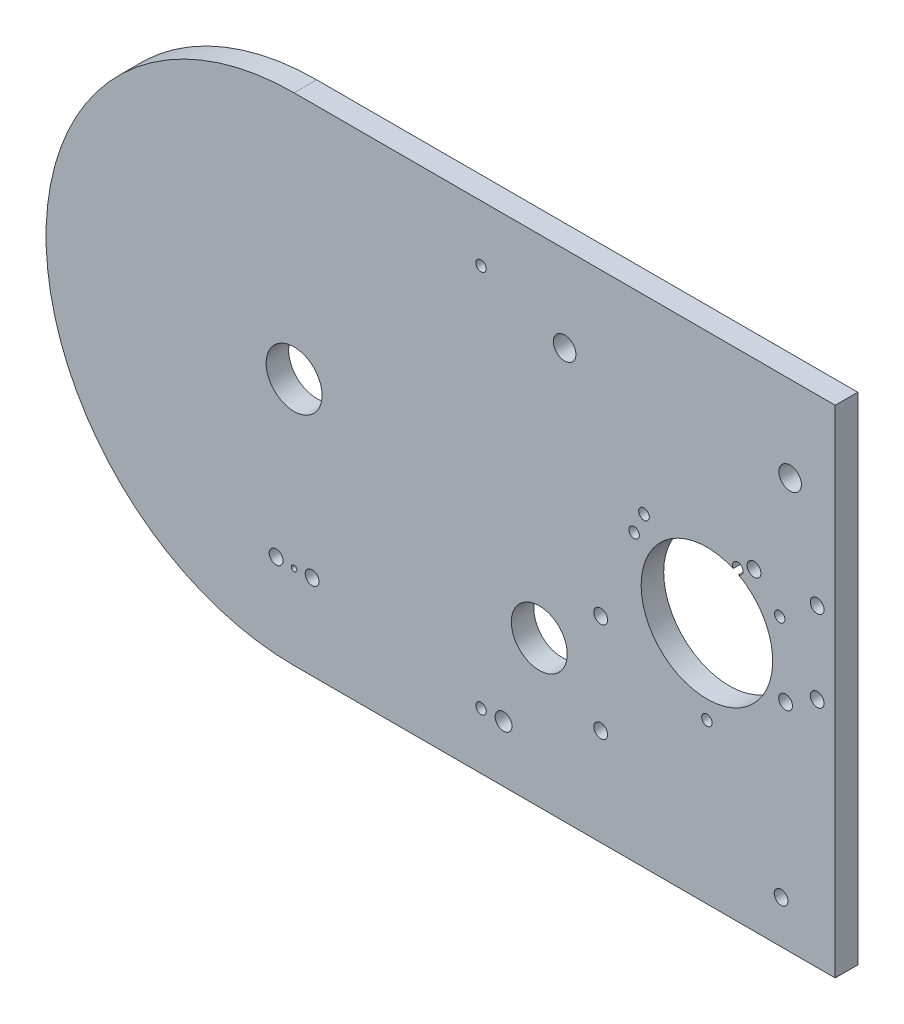
ISO-10303-21;
HEADER;
FILE_DESCRIPTION(('STEP AP214'),'2;1');
FILE_NAME('part.step','',(''),(''),'','','');
FILE_SCHEMA(('AUTOMOTIVE_DESIGN { 1 0 10303 214 1 1 1 1 }'));
ENDSEC;
DATA;
#1=APPLICATION_CONTEXT('core data for automotive mechanical design processes');
#2=APPLICATION_PROTOCOL_DEFINITION('international standard','automotive_design',2000,#1);
#3=PRODUCT_CONTEXT('',#1,'mechanical');
#4=PRODUCT('Part','Part','',(#3));
#5=PRODUCT_RELATED_PRODUCT_CATEGORY('part','',(#4));
#6=PRODUCT_DEFINITION_FORMATION('','',#4);
#7=PRODUCT_DEFINITION_CONTEXT('part definition',#1,'design');
#8=PRODUCT_DEFINITION('design','',#6,#7);
#9=PRODUCT_DEFINITION_SHAPE('','',#8);
#10=(LENGTH_UNIT() NAMED_UNIT(*) SI_UNIT(.MILLI.,.METRE.));
#11=(NAMED_UNIT(*) PLANE_ANGLE_UNIT() SI_UNIT($,.RADIAN.));
#12=(NAMED_UNIT(*) SI_UNIT($,.STERADIAN.) SOLID_ANGLE_UNIT());
#13=UNCERTAINTY_MEASURE_WITH_UNIT(LENGTH_MEASURE(1.E-05),#10,'distance_accuracy_value','');
#14=(GEOMETRIC_REPRESENTATION_CONTEXT(3) GLOBAL_UNCERTAINTY_ASSIGNED_CONTEXT((#13)) GLOBAL_UNIT_ASSIGNED_CONTEXT((#10,
#11,#12)) REPRESENTATION_CONTEXT('',''));
#15=CARTESIAN_POINT('',(0.,0.,0.));
#16=DIRECTION('',(0.,0.,1.));
#17=DIRECTION('',(1.,0.,0.));
#18=AXIS2_PLACEMENT_3D('',#15,#16,#17);
#19=CARTESIAN_POINT('',(0.,0.,6.35));
#20=DIRECTION('',(0.,0.,1.));
#21=DIRECTION('',(1.,0.,0.));
#22=AXIS2_PLACEMENT_3D('',#19,#20,#21);
#23=PLANE('',#22);
#24=CARTESIAN_POINT('',(116.268983634015,-25.0154088515495,6.35));
#25=DIRECTION('',(0.,0.,-1.));
#26=DIRECTION('',(-1.,0.,0.));
#27=AXIS2_PLACEMENT_3D('',#24,#25,#26);
#28=CIRCLE('',#27,1.47319999999998);
#29=CARTESIAN_POINT('',(114.795783634015,-25.0154088515495,6.35));
#30=VERTEX_POINT('',#29);
#31=EDGE_CURVE('E534',#30,#30,#28,.F.);
#32=ORIENTED_EDGE('',*,*,#31,.F.);
#33=EDGE_LOOP('',(#32));
#34=FACE_BOUND('',#33,.T.);
#35=CARTESIAN_POINT('',(136.769352977,10.4922724244268,6.35));
#36=DIRECTION('',(0.,0.,-1.));
#37=DIRECTION('',(-1.,0.,0.));
#38=AXIS2_PLACEMENT_3D('',#35,#36,#37);
#39=CIRCLE('',#38,1.47319999999997);
#40=CARTESIAN_POINT('',(135.296152977,10.4922724244268,6.35));
#41=VERTEX_POINT('',#40);
#42=EDGE_CURVE('E538',#41,#41,#39,.F.);
#43=ORIENTED_EDGE('',*,*,#42,.F.);
#44=EDGE_LOOP('',(#43));
#45=FACE_BOUND('',#44,.T.);
#46=CARTESIAN_POINT('',(95.7686142910309,10.4922724244268,6.35));
#47=DIRECTION('',(0.,0.,-1.));
#48=DIRECTION('',(-1.,0.,0.));
#49=AXIS2_PLACEMENT_3D('',#46,#47,#48);
#50=CIRCLE('',#49,1.4732);
#51=CARTESIAN_POINT('',(94.2954142910309,10.4922724244268,6.35));
#52=VERTEX_POINT('',#51);
#53=EDGE_CURVE('E546',#52,#52,#50,.F.);
#54=ORIENTED_EDGE('',*,*,#53,.F.);
#55=EDGE_LOOP('',(#54));
#56=FACE_BOUND('',#55,.T.);
#57=CARTESIAN_POINT('',(116.268983634015,-1.34362133423192,6.35));
#58=DIRECTION('',(0.,0.,-1.));
#59=DIRECTION('',(-1.,0.,0.));
#60=AXIS2_PLACEMENT_3D('',#57,#58,#59);
#61=CIRCLE('',#60,18.5269999999999);
#62=CARTESIAN_POINT('',(123.664724974641,15.6432188375763,6.35));
#63=VERTEX_POINT('',#62);
#64=CARTESIAN_POINT('',(125.180243201368,14.8995058869427,6.35));
#65=VERTEX_POINT('',#64);
#66=EDGE_CURVE('E101',#63,#65,#61,.F.);
#67=ORIENTED_EDGE('',*,*,#66,.F.);
#68=CARTESIAN_POINT('',(124.968,16.382999999999,6.35));
#69=DIRECTION('',(0.,0.,1.));
#70=DIRECTION('',(1.,0.,0.));
#71=AXIS2_PLACEMENT_3D('',#68,#69,#70);
#72=CIRCLE('',#71,1.49859999999997);
#73=EDGE_CURVE('E92',#65,#63,#72,.T.);
#74=ORIENTED_EDGE('',*,*,#73,.F.);
#75=EDGE_LOOP('',(#67,#74));
#76=FACE_BOUND('',#75,.T.);
#77=CARTESIAN_POINT('',(98.5519999999999,16.382999999999,6.35));
#78=DIRECTION('',(0.,0.,1.));
#79=DIRECTION('',(1.,0.,0.));
#80=AXIS2_PLACEMENT_3D('',#77,#78,#79);
#81=CIRCLE('',#80,1.49859999999999);
#82=CARTESIAN_POINT('',(100.0506,16.382999999999,6.35));
#83=VERTEX_POINT('',#82);
#84=EDGE_CURVE('E107',#83,#83,#81,.T.);
#85=ORIENTED_EDGE('',*,*,#84,.F.);
#86=EDGE_LOOP('',(#85));
#87=FACE_BOUND('',#86,.T.);
#88=CARTESIAN_POINT('',(59.0043258396006,-53.975,6.35));
#89=DIRECTION('',(0.,0.,1.));
#90=DIRECTION('',(1.,0.,0.));
#91=AXIS2_PLACEMENT_3D('',#88,#89,#90);
#92=CIRCLE('',#91,2.38125);
#93=CARTESIAN_POINT('',(61.3855758396006,-53.975,6.35));
#94=VERTEX_POINT('',#93);
#95=EDGE_CURVE('E116',#94,#94,#92,.T.);
#96=ORIENTED_EDGE('',*,*,#95,.F.);
#97=EDGE_LOOP('',(#96));
#98=FACE_BOUND('',#97,.T.);
#99=CARTESIAN_POINT('',(0.00594458088814826,-46.140475683147,6.35));
#100=DIRECTION('',(0.,0.,1.));
#101=DIRECTION('',(1.,0.,0.));
#102=AXIS2_PLACEMENT_3D('',#99,#100,#101);
#103=CIRCLE('',#102,0.793749999999994);
#104=CARTESIAN_POINT('',(0.799694580888142,-46.140475683147,6.35));
#105=VERTEX_POINT('',#104);
#106=EDGE_CURVE('E122',#105,#105,#103,.T.);
#107=ORIENTED_EDGE('',*,*,#106,.F.);
#108=EDGE_LOOP('',(#107));
#109=FACE_BOUND('',#108,.T.);
#110=CARTESIAN_POINT('',(129.54,18.414999999999,6.35));
#111=DIRECTION('',(0.,0.,1.));
#112=DIRECTION('',(1.,0.,0.));
#113=AXIS2_PLACEMENT_3D('',#110,#111,#112);
#114=CIRCLE('',#113,1.94309999999998);
#115=CARTESIAN_POINT('',(131.4831,18.414999999999,6.35));
#116=VERTEX_POINT('',#115);
#117=EDGE_CURVE('E128',#116,#116,#114,.T.);
#118=ORIENTED_EDGE('',*,*,#117,.F.);
#119=EDGE_LOOP('',(#118));
#120=FACE_BOUND('',#119,.T.);
#121=CARTESIAN_POINT('',(147.32,18.414999999999,6.35));
#122=DIRECTION('',(0.,0.,1.));
#123=DIRECTION('',(1.,0.,0.));
#124=AXIS2_PLACEMENT_3D('',#121,#122,#123);
#125=CIRCLE('',#124,1.94309999999998);
#126=CARTESIAN_POINT('',(149.2631,18.414999999999,6.35));
#127=VERTEX_POINT('',#126);
#128=EDGE_CURVE('E134',#127,#127,#125,.T.);
#129=ORIENTED_EDGE('',*,*,#128,.F.);
#130=EDGE_LOOP('',(#129));
#131=FACE_BOUND('',#130,.T.);
#132=CARTESIAN_POINT('',(147.32,-4.44500000000105,6.35));
#133=DIRECTION('',(0.,0.,1.));
#134=DIRECTION('',(1.,0.,0.));
#135=AXIS2_PLACEMENT_3D('',#132,#133,#134);
#136=CIRCLE('',#135,1.94309999999998);
#137=CARTESIAN_POINT('',(149.2631,-4.44500000000105,6.35));
#138=VERTEX_POINT('',#137);
#139=EDGE_CURVE('E140',#138,#138,#136,.T.);
#140=ORIENTED_EDGE('',*,*,#139,.F.);
#141=EDGE_LOOP('',(#140));
#142=FACE_BOUND('',#141,.T.);
#143=CARTESIAN_POINT('',(138.43,-9.52500000000096,6.35));
#144=DIRECTION('',(0.,0.,1.));
#145=DIRECTION('',(1.,0.,0.));
#146=AXIS2_PLACEMENT_3D('',#143,#144,#145);
#147=CIRCLE('',#146,1.94309999999998);
#148=CARTESIAN_POINT('',(140.3731,-9.52500000000096,6.35));
#149=VERTEX_POINT('',#148);
#150=EDGE_CURVE('E146',#149,#149,#147,.T.);
#151=ORIENTED_EDGE('',*,*,#150,.F.);
#152=EDGE_LOOP('',(#151));
#153=FACE_BOUND('',#152,.T.);
#154=CARTESIAN_POINT('',(86.3599999999988,-14.6050000000013,6.35));
#155=DIRECTION('',(0.,0.,1.));
#156=DIRECTION('',(1.,0.,0.));
#157=AXIS2_PLACEMENT_3D('',#154,#155,#156);
#158=CIRCLE('',#157,1.94309999999999);
#159=CARTESIAN_POINT('',(88.3030999999988,-14.6050000000013,6.35));
#160=VERTEX_POINT('',#159);
#161=EDGE_CURVE('E152',#160,#160,#158,.T.);
#162=ORIENTED_EDGE('',*,*,#161,.F.);
#163=EDGE_LOOP('',(#162));
#164=FACE_BOUND('',#163,.T.);
#165=CARTESIAN_POINT('',(86.36,-42.5449999999997,6.35));
#166=DIRECTION('',(0.,0.,1.));
#167=DIRECTION('',(1.,0.,0.));
#168=AXIS2_PLACEMENT_3D('',#165,#166,#167);
#169=CIRCLE('',#168,1.94309999999999);
#170=CARTESIAN_POINT('',(88.3031,-42.5449999999997,6.35));
#171=VERTEX_POINT('',#170);
#172=EDGE_CURVE('E158',#171,#171,#169,.T.);
#173=ORIENTED_EDGE('',*,*,#172,.F.);
#174=EDGE_LOOP('',(#173));
#175=FACE_BOUND('',#174,.T.);
#176=CARTESIAN_POINT('',(137.16,-57.785000000001,6.35));
#177=DIRECTION('',(0.,0.,1.));
#178=DIRECTION('',(1.,0.,0.));
#179=AXIS2_PLACEMENT_3D('',#176,#177,#178);
#180=CIRCLE('',#179,1.94309999999998);
#181=CARTESIAN_POINT('',(139.1031,-57.785000000001,6.35));
#182=VERTEX_POINT('',#181);
#183=EDGE_CURVE('E164',#182,#182,#180,.T.);
#184=ORIENTED_EDGE('',*,*,#183,.F.);
#185=EDGE_LOOP('',(#184));
#186=FACE_BOUND('',#185,.T.);
#187=CARTESIAN_POINT('',(5.07324458088815,-45.872975683147,6.35));
#188=DIRECTION('',(0.,0.,1.));
#189=DIRECTION('',(1.,0.,0.));
#190=AXIS2_PLACEMENT_3D('',#187,#188,#189);
#191=CIRCLE('',#190,1.94309999999999);
#192=CARTESIAN_POINT('',(7.01634458088814,-45.872975683147,6.35));
#193=VERTEX_POINT('',#192);
#194=EDGE_CURVE('E170',#193,#193,#191,.T.);
#195=ORIENTED_EDGE('',*,*,#194,.F.);
#196=EDGE_LOOP('',(#195));
#197=FACE_BOUND('',#196,.T.);
#198=CARTESIAN_POINT('',(-5.06135541911185,-45.872975683147,6.35));
#199=DIRECTION('',(0.,0.,1.));
#200=DIRECTION('',(1.,0.,0.));
#201=AXIS2_PLACEMENT_3D('',#198,#199,#200);
#202=CIRCLE('',#201,1.94309999999999);
#203=CARTESIAN_POINT('',(-3.11825541911186,-45.872975683147,6.35));
#204=VERTEX_POINT('',#203);
#205=EDGE_CURVE('E176',#204,#204,#202,.T.);
#206=ORIENTED_EDGE('',*,*,#205,.F.);
#207=EDGE_LOOP('',(#206));
#208=FACE_BOUND('',#207,.T.);
#209=CARTESIAN_POINT('',(52.6543258396006,53.9749999999996,6.35));
#210=DIRECTION('',(0.,0.,1.));
#211=DIRECTION('',(1.,0.,0.));
#212=AXIS2_PLACEMENT_3D('',#209,#210,#211);
#213=CIRCLE('',#212,1.47319999999999);
#214=CARTESIAN_POINT('',(54.1275258396006,53.9749999999996,6.35));
#215=VERTEX_POINT('',#214);
#216=EDGE_CURVE('E182',#215,#215,#213,.T.);
#217=ORIENTED_EDGE('',*,*,#216,.F.);
#218=EDGE_LOOP('',(#217));
#219=FACE_BOUND('',#218,.T.);
#220=CARTESIAN_POINT('',(52.6543258396006,-53.975,6.35));
#221=DIRECTION('',(0.,0.,1.));
#222=DIRECTION('',(1.,0.,0.));
#223=AXIS2_PLACEMENT_3D('',#220,#221,#222);
#224=CIRCLE('',#223,1.47319999999999);
#225=CARTESIAN_POINT('',(54.1275258396006,-53.975,6.35));
#226=VERTEX_POINT('',#225);
#227=EDGE_CURVE('E188',#226,#226,#224,.T.);
#228=ORIENTED_EDGE('',*,*,#227,.F.);
#229=EDGE_LOOP('',(#228));
#230=FACE_BOUND('',#229,.T.);
#231=CARTESIAN_POINT('',(139.7,45.72,6.35));
#232=DIRECTION('',(0.,0.,1.));
#233=DIRECTION('',(1.,0.,0.));
#234=AXIS2_PLACEMENT_3D('',#231,#232,#233);
#235=CIRCLE('',#234,3.17499999999997);
#236=CARTESIAN_POINT('',(142.875,45.72,6.35));
#237=VERTEX_POINT('',#236);
#238=EDGE_CURVE('E194',#237,#237,#235,.T.);
#239=ORIENTED_EDGE('',*,*,#238,.F.);
#240=EDGE_LOOP('',(#239));
#241=FACE_BOUND('',#240,.T.);
#242=CARTESIAN_POINT('',(76.2,45.72,6.35));
#243=DIRECTION('',(0.,0.,1.));
#244=DIRECTION('',(1.,0.,0.));
#245=AXIS2_PLACEMENT_3D('',#242,#243,#244);
#246=CIRCLE('',#245,3.17499999999997);
#247=CARTESIAN_POINT('',(79.375,45.72,6.35));
#248=VERTEX_POINT('',#247);
#249=EDGE_CURVE('E200',#248,#248,#246,.T.);
#250=ORIENTED_EDGE('',*,*,#249,.F.);
#251=EDGE_LOOP('',(#250));
#252=FACE_BOUND('',#251,.T.);
#253=CARTESIAN_POINT('',(69.0541023726346,-28.603145740244,6.35));
#254=DIRECTION('',(0.,0.,1.));
#255=DIRECTION('',(1.,0.,0.));
#256=AXIS2_PLACEMENT_3D('',#253,#254,#255);
#257=CIRCLE('',#256,7.87399999999999);
#258=CARTESIAN_POINT('',(76.9281023726346,-28.603145740244,6.35));
#259=VERTEX_POINT('',#258);
#260=EDGE_CURVE('E213',#259,#259,#257,.T.);
#261=ORIENTED_EDGE('',*,*,#260,.F.);
#262=EDGE_LOOP('',(#261));
#263=FACE_BOUND('',#262,.T.);
#264=CARTESIAN_POINT('',(0.,0.,6.35));
#265=DIRECTION('',(0.,0.,1.));
#266=DIRECTION('',(1.,0.,0.));
#267=AXIS2_PLACEMENT_3D('',#264,#265,#266);
#268=CIRCLE('',#267,69.85);
#269=CARTESIAN_POINT('',(0.,69.85,6.35));
#270=VERTEX_POINT('',#269);
#271=CARTESIAN_POINT('',(0.,-69.85,6.35));
#272=VERTEX_POINT('',#271);
#273=EDGE_CURVE('E219',#270,#272,#268,.T.);
#274=ORIENTED_EDGE('',*,*,#273,.T.);
#275=DIRECTION('',(1.,0.,0.));
#276=VECTOR('',#275,1.);
#277=CARTESIAN_POINT('',(0.,-69.85,6.35));
#278=LINE('',#277,#276);
#279=CARTESIAN_POINT('',(152.4,-69.85,6.35));
#280=VERTEX_POINT('',#279);
#281=EDGE_CURVE('E222',#272,#280,#278,.T.);
#282=ORIENTED_EDGE('',*,*,#281,.T.);
#283=DIRECTION('',(0.,1.,0.));
#284=VECTOR('',#283,1.);
#285=CARTESIAN_POINT('',(152.4,69.85,6.35));
#286=LINE('',#285,#284);
#287=CARTESIAN_POINT('',(152.4,69.85,6.35));
#288=VERTEX_POINT('',#287);
#289=EDGE_CURVE('E226',#280,#288,#286,.T.);
#290=ORIENTED_EDGE('',*,*,#289,.T.);
#291=DIRECTION('',(-1.,0.,0.));
#292=VECTOR('',#291,1.);
#293=CARTESIAN_POINT('',(0.,69.85,6.35));
#294=LINE('',#293,#292);
#295=EDGE_CURVE('E229',#288,#270,#294,.T.);
#296=ORIENTED_EDGE('',*,*,#295,.T.);
#297=EDGE_LOOP('',(#274,#282,#290,#296));
#298=FACE_BOUND('',#297,.T.);
#299=CARTESIAN_POINT('',(0.,0.,6.35));
#300=DIRECTION('',(0.,0.,1.));
#301=DIRECTION('',(1.,0.,0.));
#302=AXIS2_PLACEMENT_3D('',#299,#300,#301);
#303=CIRCLE('',#302,7.874);
#304=CARTESIAN_POINT('',(7.874,0.,6.35));
#305=VERTEX_POINT('',#304);
#306=EDGE_CURVE('E207',#305,#305,#303,.T.);
#307=ORIENTED_EDGE('',*,*,#306,.F.);
#308=EDGE_LOOP('',(#307));
#309=FACE_BOUND('',#308,.T.);
#310=ADVANCED_FACE('F32',(#34,#45,#56,#76,#87,#98,#109,#120,#131,#142,#153,#164,#175,#186,#197,
#208,#219,#230,#241,#252,#263,#298,#309),#23,.T.);
#311=CARTESIAN_POINT('',(0.,0.,0.));
#312=DIRECTION('',(0.,0.,1.));
#313=DIRECTION('',(1.,0.,0.));
#314=AXIS2_PLACEMENT_3D('',#311,#312,#313);
#315=PLANE('',#314);
#316=CARTESIAN_POINT('',(116.268983634015,-25.0154088515495,0.));
#317=DIRECTION('',(0.,0.,1.));
#318=DIRECTION('',(1.,0.,0.));
#319=AXIS2_PLACEMENT_3D('',#316,#317,#318);
#320=CIRCLE('',#319,1.47319999999998);
#321=CARTESIAN_POINT('',(117.742183634015,-25.0154088515495,0.));
#322=VERTEX_POINT('',#321);
#323=EDGE_CURVE('E537',#322,#322,#320,.T.);
#324=ORIENTED_EDGE('',*,*,#323,.T.);
#325=EDGE_LOOP('',(#324));
#326=FACE_BOUND('',#325,.T.);
#327=CARTESIAN_POINT('',(136.769352977,10.4922724244268,0.));
#328=DIRECTION('',(0.,0.,1.));
#329=DIRECTION('',(1.,0.,0.));
#330=AXIS2_PLACEMENT_3D('',#327,#328,#329);
#331=CIRCLE('',#330,1.47319999999997);
#332=CARTESIAN_POINT('',(138.242552977,10.4922724244268,0.));
#333=VERTEX_POINT('',#332);
#334=EDGE_CURVE('E541',#333,#333,#331,.T.);
#335=ORIENTED_EDGE('',*,*,#334,.T.);
#336=EDGE_LOOP('',(#335));
#337=FACE_BOUND('',#336,.T.);
#338=CARTESIAN_POINT('',(95.7686142910309,10.4922724244268,0.));
#339=DIRECTION('',(0.,0.,1.));
#340=DIRECTION('',(1.,0.,0.));
#341=AXIS2_PLACEMENT_3D('',#338,#339,#340);
#342=CIRCLE('',#341,1.4732);
#343=CARTESIAN_POINT('',(97.2418142910309,10.4922724244268,0.));
#344=VERTEX_POINT('',#343);
#345=EDGE_CURVE('E97',#344,#344,#342,.T.);
#346=ORIENTED_EDGE('',*,*,#345,.T.);
#347=EDGE_LOOP('',(#346));
#348=FACE_BOUND('',#347,.T.);
#349=CARTESIAN_POINT('',(98.5519999999999,16.382999999999,0.));
#350=DIRECTION('',(0.,0.,1.));
#351=DIRECTION('',(1.,0.,0.));
#352=AXIS2_PLACEMENT_3D('',#349,#350,#351);
#353=CIRCLE('',#352,1.4986);
#354=CARTESIAN_POINT('',(100.0506,16.382999999999,0.));
#355=VERTEX_POINT('',#354);
#356=EDGE_CURVE('E102',#355,#355,#353,.T.);
#357=ORIENTED_EDGE('',*,*,#356,.T.);
#358=EDGE_LOOP('',(#357));
#359=FACE_BOUND('',#358,.T.);
#360=CARTESIAN_POINT('',(124.968,16.382999999999,0.));
#361=DIRECTION('',(0.,0.,1.));
#362=DIRECTION('',(1.,0.,0.));
#363=AXIS2_PLACEMENT_3D('',#360,#361,#362);
#364=CIRCLE('',#363,1.49859999999999);
#365=CARTESIAN_POINT('',(125.180243201368,14.8995058869426,0.));
#366=VERTEX_POINT('',#365);
#367=CARTESIAN_POINT('',(123.664724974641,15.6432188375763,0.));
#368=VERTEX_POINT('',#367);
#369=EDGE_CURVE('E95',#366,#368,#364,.T.);
#370=ORIENTED_EDGE('',*,*,#369,.T.);
#371=CARTESIAN_POINT('',(116.268983634015,-1.34362133423192,0.));
#372=DIRECTION('',(0.,0.,-1.));
#373=DIRECTION('',(-1.,0.,0.));
#374=AXIS2_PLACEMENT_3D('',#371,#372,#373);
#375=CIRCLE('',#374,18.5269999999999);
#376=EDGE_CURVE('E96',#368,#366,#375,.F.);
#377=ORIENTED_EDGE('',*,*,#376,.T.);
#378=EDGE_LOOP('',(#370,#377));
#379=FACE_BOUND('',#378,.T.);
#380=CARTESIAN_POINT('',(59.0043258396006,-53.975,0.));
#381=DIRECTION('',(0.,0.,1.));
#382=DIRECTION('',(1.,0.,0.));
#383=AXIS2_PLACEMENT_3D('',#380,#381,#382);
#384=CIRCLE('',#383,2.38125);
#385=CARTESIAN_POINT('',(61.3855758396006,-53.975,0.));
#386=VERTEX_POINT('',#385);
#387=EDGE_CURVE('E119',#386,#386,#384,.F.);
#388=ORIENTED_EDGE('',*,*,#387,.F.);
#389=EDGE_LOOP('',(#388));
#390=FACE_BOUND('',#389,.T.);
#391=CARTESIAN_POINT('',(0.00594458088814826,-46.140475683147,0.));
#392=DIRECTION('',(0.,0.,1.));
#393=DIRECTION('',(1.,0.,0.));
#394=AXIS2_PLACEMENT_3D('',#391,#392,#393);
#395=CIRCLE('',#394,0.793749999999994);
#396=CARTESIAN_POINT('',(0.799694580888142,-46.140475683147,0.));
#397=VERTEX_POINT('',#396);
#398=EDGE_CURVE('E125',#397,#397,#395,.F.);
#399=ORIENTED_EDGE('',*,*,#398,.F.);
#400=EDGE_LOOP('',(#399));
#401=FACE_BOUND('',#400,.T.);
#402=CARTESIAN_POINT('',(129.54,18.414999999999,0.));
#403=DIRECTION('',(0.,0.,1.));
#404=DIRECTION('',(1.,0.,0.));
#405=AXIS2_PLACEMENT_3D('',#402,#403,#404);
#406=CIRCLE('',#405,1.94309999999999);
#407=CARTESIAN_POINT('',(131.4831,18.414999999999,0.));
#408=VERTEX_POINT('',#407);
#409=EDGE_CURVE('E131',#408,#408,#406,.T.);
#410=ORIENTED_EDGE('',*,*,#409,.T.);
#411=EDGE_LOOP('',(#410));
#412=FACE_BOUND('',#411,.T.);
#413=CARTESIAN_POINT('',(147.32,18.414999999999,0.));
#414=DIRECTION('',(0.,0.,1.));
#415=DIRECTION('',(1.,0.,0.));
#416=AXIS2_PLACEMENT_3D('',#413,#414,#415);
#417=CIRCLE('',#416,1.94309999999999);
#418=CARTESIAN_POINT('',(149.2631,18.414999999999,0.));
#419=VERTEX_POINT('',#418);
#420=EDGE_CURVE('E137',#419,#419,#417,.T.);
#421=ORIENTED_EDGE('',*,*,#420,.T.);
#422=EDGE_LOOP('',(#421));
#423=FACE_BOUND('',#422,.T.);
#424=CARTESIAN_POINT('',(147.32,-4.44500000000105,0.));
#425=DIRECTION('',(0.,0.,1.));
#426=DIRECTION('',(1.,0.,0.));
#427=AXIS2_PLACEMENT_3D('',#424,#425,#426);
#428=CIRCLE('',#427,1.94309999999999);
#429=CARTESIAN_POINT('',(149.2631,-4.44500000000105,0.));
#430=VERTEX_POINT('',#429);
#431=EDGE_CURVE('E143',#430,#430,#428,.T.);
#432=ORIENTED_EDGE('',*,*,#431,.T.);
#433=EDGE_LOOP('',(#432));
#434=FACE_BOUND('',#433,.T.);
#435=CARTESIAN_POINT('',(138.43,-9.52500000000096,0.));
#436=DIRECTION('',(0.,0.,1.));
#437=DIRECTION('',(1.,0.,0.));
#438=AXIS2_PLACEMENT_3D('',#435,#436,#437);
#439=CIRCLE('',#438,1.94309999999999);
#440=CARTESIAN_POINT('',(140.3731,-9.52500000000096,0.));
#441=VERTEX_POINT('',#440);
#442=EDGE_CURVE('E149',#441,#441,#439,.T.);
#443=ORIENTED_EDGE('',*,*,#442,.T.);
#444=EDGE_LOOP('',(#443));
#445=FACE_BOUND('',#444,.T.);
#446=CARTESIAN_POINT('',(86.3599999999988,-14.6050000000013,0.));
#447=DIRECTION('',(0.,0.,1.));
#448=DIRECTION('',(1.,0.,0.));
#449=AXIS2_PLACEMENT_3D('',#446,#447,#448);
#450=CIRCLE('',#449,1.9431);
#451=CARTESIAN_POINT('',(88.3030999999988,-14.6050000000013,0.));
#452=VERTEX_POINT('',#451);
#453=EDGE_CURVE('E155',#452,#452,#450,.T.);
#454=ORIENTED_EDGE('',*,*,#453,.T.);
#455=EDGE_LOOP('',(#454));
#456=FACE_BOUND('',#455,.T.);
#457=CARTESIAN_POINT('',(86.36,-42.5449999999997,0.));
#458=DIRECTION('',(0.,0.,1.));
#459=DIRECTION('',(1.,0.,0.));
#460=AXIS2_PLACEMENT_3D('',#457,#458,#459);
#461=CIRCLE('',#460,1.9431);
#462=CARTESIAN_POINT('',(88.3031,-42.5449999999997,0.));
#463=VERTEX_POINT('',#462);
#464=EDGE_CURVE('E161',#463,#463,#461,.T.);
#465=ORIENTED_EDGE('',*,*,#464,.T.);
#466=EDGE_LOOP('',(#465));
#467=FACE_BOUND('',#466,.T.);
#468=CARTESIAN_POINT('',(137.16,-57.785000000001,0.));
#469=DIRECTION('',(0.,0.,1.));
#470=DIRECTION('',(1.,0.,0.));
#471=AXIS2_PLACEMENT_3D('',#468,#469,#470);
#472=CIRCLE('',#471,1.94309999999999);
#473=CARTESIAN_POINT('',(139.1031,-57.785000000001,0.));
#474=VERTEX_POINT('',#473);
#475=EDGE_CURVE('E167',#474,#474,#472,.T.);
#476=ORIENTED_EDGE('',*,*,#475,.T.);
#477=EDGE_LOOP('',(#476));
#478=FACE_BOUND('',#477,.T.);
#479=CARTESIAN_POINT('',(5.07324458088815,-45.872975683147,0.));
#480=DIRECTION('',(0.,0.,1.));
#481=DIRECTION('',(1.,0.,0.));
#482=AXIS2_PLACEMENT_3D('',#479,#480,#481);
#483=CIRCLE('',#482,1.94309999999999);
#484=CARTESIAN_POINT('',(7.01634458088815,-45.872975683147,0.));
#485=VERTEX_POINT('',#484);
#486=EDGE_CURVE('E173',#485,#485,#483,.T.);
#487=ORIENTED_EDGE('',*,*,#486,.T.);
#488=EDGE_LOOP('',(#487));
#489=FACE_BOUND('',#488,.T.);
#490=CARTESIAN_POINT('',(-5.06135541911185,-45.872975683147,0.));
#491=DIRECTION('',(0.,0.,1.));
#492=DIRECTION('',(1.,0.,0.));
#493=AXIS2_PLACEMENT_3D('',#490,#491,#492);
#494=CIRCLE('',#493,1.94309999999999);
#495=CARTESIAN_POINT('',(-3.11825541911185,-45.872975683147,0.));
#496=VERTEX_POINT('',#495);
#497=EDGE_CURVE('E179',#496,#496,#494,.T.);
#498=ORIENTED_EDGE('',*,*,#497,.T.);
#499=EDGE_LOOP('',(#498));
#500=FACE_BOUND('',#499,.T.);
#501=CARTESIAN_POINT('',(52.6543258396006,53.9749999999996,0.));
#502=DIRECTION('',(0.,0.,1.));
#503=DIRECTION('',(1.,0.,0.));
#504=AXIS2_PLACEMENT_3D('',#501,#502,#503);
#505=CIRCLE('',#504,1.47319999999999);
#506=CARTESIAN_POINT('',(54.1275258396006,53.9749999999996,0.));
#507=VERTEX_POINT('',#506);
#508=EDGE_CURVE('E185',#507,#507,#505,.T.);
#509=ORIENTED_EDGE('',*,*,#508,.T.);
#510=EDGE_LOOP('',(#509));
#511=FACE_BOUND('',#510,.T.);
#512=CARTESIAN_POINT('',(52.6543258396006,-53.975,0.));
#513=DIRECTION('',(0.,0.,1.));
#514=DIRECTION('',(1.,0.,0.));
#515=AXIS2_PLACEMENT_3D('',#512,#513,#514);
#516=CIRCLE('',#515,1.47319999999999);
#517=CARTESIAN_POINT('',(54.1275258396006,-53.975,0.));
#518=VERTEX_POINT('',#517);
#519=EDGE_CURVE('E191',#518,#518,#516,.T.);
#520=ORIENTED_EDGE('',*,*,#519,.T.);
#521=EDGE_LOOP('',(#520));
#522=FACE_BOUND('',#521,.T.);
#523=CARTESIAN_POINT('',(139.7,45.72,0.));
#524=DIRECTION('',(0.,0.,1.));
#525=DIRECTION('',(1.,0.,0.));
#526=AXIS2_PLACEMENT_3D('',#523,#524,#525);
#527=CIRCLE('',#526,3.17499999999997);
#528=CARTESIAN_POINT('',(142.875,45.72,0.));
#529=VERTEX_POINT('',#528);
#530=EDGE_CURVE('E197',#529,#529,#527,.F.);
#531=ORIENTED_EDGE('',*,*,#530,.F.);
#532=EDGE_LOOP('',(#531));
#533=FACE_BOUND('',#532,.T.);
#534=CARTESIAN_POINT('',(76.2,45.72,0.));
#535=DIRECTION('',(0.,0.,1.));
#536=DIRECTION('',(1.,0.,0.));
#537=AXIS2_PLACEMENT_3D('',#534,#535,#536);
#538=CIRCLE('',#537,3.17499999999997);
#539=CARTESIAN_POINT('',(79.375,45.72,0.));
#540=VERTEX_POINT('',#539);
#541=EDGE_CURVE('E203',#540,#540,#538,.F.);
#542=ORIENTED_EDGE('',*,*,#541,.F.);
#543=EDGE_LOOP('',(#542));
#544=FACE_BOUND('',#543,.T.);
#545=CARTESIAN_POINT('',(69.0541023726346,-28.603145740244,0.));
#546=DIRECTION('',(0.,0.,1.));
#547=DIRECTION('',(1.,0.,0.));
#548=AXIS2_PLACEMENT_3D('',#545,#546,#547);
#549=CIRCLE('',#548,7.87399999999999);
#550=CARTESIAN_POINT('',(76.9281023726346,-28.603145740244,0.));
#551=VERTEX_POINT('',#550);
#552=EDGE_CURVE('E210',#551,#551,#549,.T.);
#553=ORIENTED_EDGE('',*,*,#552,.T.);
#554=EDGE_LOOP('',(#553));
#555=FACE_BOUND('',#554,.T.);
#556=CARTESIAN_POINT('',(0.,0.,0.));
#557=DIRECTION('',(0.,0.,1.));
#558=DIRECTION('',(1.,0.,0.));
#559=AXIS2_PLACEMENT_3D('',#556,#557,#558);
#560=CIRCLE('',#559,69.85);
#561=CARTESIAN_POINT('',(0.,69.85,0.));
#562=VERTEX_POINT('',#561);
#563=CARTESIAN_POINT('',(0.,-69.85,0.));
#564=VERTEX_POINT('',#563);
#565=EDGE_CURVE('E216',#562,#564,#560,.T.);
#566=ORIENTED_EDGE('',*,*,#565,.F.);
#567=DIRECTION('',(-1.,0.,0.));
#568=VECTOR('',#567,1.);
#569=CARTESIAN_POINT('',(0.,69.85,0.));
#570=LINE('',#569,#568);
#571=CARTESIAN_POINT('',(152.4,69.85,0.));
#572=VERTEX_POINT('',#571);
#573=EDGE_CURVE('E223',#572,#562,#570,.T.);
#574=ORIENTED_EDGE('',*,*,#573,.F.);
#575=DIRECTION('',(0.,1.,0.));
#576=VECTOR('',#575,1.);
#577=CARTESIAN_POINT('',(152.4,69.85,0.));
#578=LINE('',#577,#576);
#579=CARTESIAN_POINT('',(152.4,-69.85,0.));
#580=VERTEX_POINT('',#579);
#581=EDGE_CURVE('E235',#580,#572,#578,.T.);
#582=ORIENTED_EDGE('',*,*,#581,.F.);
#583=DIRECTION('',(1.,0.,0.));
#584=VECTOR('',#583,1.);
#585=CARTESIAN_POINT('',(0.,-69.85,0.));
#586=LINE('',#585,#584);
#587=EDGE_CURVE('E232',#564,#580,#586,.T.);
#588=ORIENTED_EDGE('',*,*,#587,.F.);
#589=EDGE_LOOP('',(#566,#574,#582,#588));
#590=FACE_BOUND('',#589,.T.);
#591=CARTESIAN_POINT('',(0.,0.,0.));
#592=DIRECTION('',(0.,0.,1.));
#593=DIRECTION('',(1.,0.,0.));
#594=AXIS2_PLACEMENT_3D('',#591,#592,#593);
#595=CIRCLE('',#594,7.874);
#596=CARTESIAN_POINT('',(7.874,0.,0.));
#597=VERTEX_POINT('',#596);
#598=EDGE_CURVE('E206',#597,#597,#595,.T.);
#599=ORIENTED_EDGE('',*,*,#598,.T.);
#600=EDGE_LOOP('',(#599));
#601=FACE_BOUND('',#600,.T.);
#602=ADVANCED_FACE('F251',(#326,#337,#348,#359,#379,#390,#401,#412,#423,#434,#445,#456,#467,
#478,#489,#500,#511,#522,#533,#544,#555,#590,#601),#315,.F.);
#603=CARTESIAN_POINT('',(0.,0.,6.35));
#604=DIRECTION('',(0.,0.,-1.));
#605=DIRECTION('',(-1.,0.,0.));
#606=AXIS2_PLACEMENT_3D('',#603,#604,#605);
#607=CYLINDRICAL_SURFACE('',#606,69.85);
#608=ORIENTED_EDGE('',*,*,#565,.T.);
#609=DIRECTION('',(0.,0.,-1.));
#610=VECTOR('',#609,1.);
#611=CARTESIAN_POINT('',(0.,-69.85,6.35));
#612=LINE('',#611,#610);
#613=EDGE_CURVE('E11',#272,#564,#612,.T.);
#614=ORIENTED_EDGE('',*,*,#613,.F.);
#615=ORIENTED_EDGE('',*,*,#273,.F.);
#616=DIRECTION('',(0.,0.,-1.));
#617=VECTOR('',#616,1.);
#618=CARTESIAN_POINT('',(0.,69.85,6.35));
#619=LINE('',#618,#617);
#620=EDGE_CURVE('E56',#270,#562,#619,.T.);
#621=ORIENTED_EDGE('',*,*,#620,.T.);
#622=EDGE_LOOP('',(#608,#614,#615,#621));
#623=FACE_BOUND('',#622,.T.);
#624=ADVANCED_FACE('F34',(#623),#607,.T.);
#625=CARTESIAN_POINT('',(0.,-69.85,6.35));
#626=DIRECTION('',(0.,1.,0.));
#627=DIRECTION('',(0.,0.,1.));
#628=AXIS2_PLACEMENT_3D('',#625,#626,#627);
#629=PLANE('',#628);
#630=ORIENTED_EDGE('',*,*,#587,.T.);
#631=DIRECTION('',(0.,0.,-1.));
#632=VECTOR('',#631,1.);
#633=CARTESIAN_POINT('',(152.4,-69.85,6.35));
#634=LINE('',#633,#632);
#635=EDGE_CURVE('E40',#280,#580,#634,.T.);
#636=ORIENTED_EDGE('',*,*,#635,.F.);
#637=ORIENTED_EDGE('',*,*,#281,.F.);
#638=ORIENTED_EDGE('',*,*,#613,.T.);
#639=EDGE_LOOP('',(#630,#636,#637,#638));
#640=FACE_BOUND('',#639,.T.);
#641=ADVANCED_FACE('F248',(#640),#629,.F.);
#642=CARTESIAN_POINT('',(152.4,69.85,6.35));
#643=DIRECTION('',(-1.,0.,0.));
#644=DIRECTION('',(0.,0.,1.));
#645=AXIS2_PLACEMENT_3D('',#642,#643,#644);
#646=PLANE('',#645);
#647=ORIENTED_EDGE('',*,*,#581,.T.);
#648=DIRECTION('',(0.,0.,-1.));
#649=VECTOR('',#648,1.);
#650=CARTESIAN_POINT('',(152.4,69.85,6.35));
#651=LINE('',#650,#649);
#652=EDGE_CURVE('E240',#288,#572,#651,.T.);
#653=ORIENTED_EDGE('',*,*,#652,.F.);
#654=ORIENTED_EDGE('',*,*,#289,.F.);
#655=ORIENTED_EDGE('',*,*,#635,.T.);
#656=EDGE_LOOP('',(#647,#653,#654,#655));
#657=FACE_BOUND('',#656,.T.);
#658=ADVANCED_FACE('F243',(#657),#646,.F.);
#659=CARTESIAN_POINT('',(0.,69.85,6.35));
#660=DIRECTION('',(0.,-1.,0.));
#661=DIRECTION('',(0.,0.,-1.));
#662=AXIS2_PLACEMENT_3D('',#659,#660,#661);
#663=PLANE('',#662);
#664=ORIENTED_EDGE('',*,*,#573,.T.);
#665=ORIENTED_EDGE('',*,*,#620,.F.);
#666=ORIENTED_EDGE('',*,*,#295,.F.);
#667=ORIENTED_EDGE('',*,*,#652,.T.);
#668=EDGE_LOOP('',(#664,#665,#666,#667));
#669=FACE_BOUND('',#668,.T.);
#670=ADVANCED_FACE('F253',(#669),#663,.F.);
#671=CARTESIAN_POINT('',(69.0541023726346,-28.603145740244,6.35));
#672=DIRECTION('',(0.,0.,-1.));
#673=DIRECTION('',(-1.,0.,0.));
#674=AXIS2_PLACEMENT_3D('',#671,#672,#673);
#675=CYLINDRICAL_SURFACE('',#674,7.87399999999999);
#676=ORIENTED_EDGE('',*,*,#260,.T.);
#677=EDGE_LOOP('',(#676));
#678=FACE_BOUND('',#677,.T.);
#679=ORIENTED_EDGE('',*,*,#552,.F.);
#680=EDGE_LOOP('',(#679));
#681=FACE_BOUND('',#680,.T.);
#682=ADVANCED_FACE('F271',(#678,#681),#675,.F.);
#683=CARTESIAN_POINT('',(0.,0.,6.35));
#684=DIRECTION('',(0.,0.,-1.));
#685=DIRECTION('',(-1.,0.,0.));
#686=AXIS2_PLACEMENT_3D('',#683,#684,#685);
#687=CYLINDRICAL_SURFACE('',#686,7.874);
#688=ORIENTED_EDGE('',*,*,#306,.T.);
#689=EDGE_LOOP('',(#688));
#690=FACE_BOUND('',#689,.T.);
#691=ORIENTED_EDGE('',*,*,#598,.F.);
#692=EDGE_LOOP('',(#691));
#693=FACE_BOUND('',#692,.T.);
#694=ADVANCED_FACE('F291',(#690,#693),#687,.F.);
#695=CARTESIAN_POINT('',(76.2,45.72,-0.00100000000000013));
#696=DIRECTION('',(0.,0.,1.));
#697=DIRECTION('',(1.,0.,0.));
#698=AXIS2_PLACEMENT_3D('',#695,#696,#697);
#699=CYLINDRICAL_SURFACE('',#698,3.17499999999997);
#700=ORIENTED_EDGE('',*,*,#249,.T.);
#701=EDGE_LOOP('',(#700));
#702=FACE_BOUND('',#701,.T.);
#703=ORIENTED_EDGE('',*,*,#541,.T.);
#704=EDGE_LOOP('',(#703));
#705=FACE_BOUND('',#704,.T.);
#706=ADVANCED_FACE('F298',(#702,#705),#699,.F.);
#707=CARTESIAN_POINT('',(139.7,45.72,-0.00100000000000013));
#708=DIRECTION('',(0.,0.,1.));
#709=DIRECTION('',(1.,0.,0.));
#710=AXIS2_PLACEMENT_3D('',#707,#708,#709);
#711=CYLINDRICAL_SURFACE('',#710,3.17499999999997);
#712=ORIENTED_EDGE('',*,*,#238,.T.);
#713=EDGE_LOOP('',(#712));
#714=FACE_BOUND('',#713,.T.);
#715=ORIENTED_EDGE('',*,*,#530,.T.);
#716=EDGE_LOOP('',(#715));
#717=FACE_BOUND('',#716,.T.);
#718=ADVANCED_FACE('F305',(#714,#717),#711,.F.);
#719=CARTESIAN_POINT('',(52.6543258396006,-53.975,6.35));
#720=DIRECTION('',(0.,0.,1.));
#721=DIRECTION('',(1.,0.,0.));
#722=AXIS2_PLACEMENT_3D('',#719,#720,#721);
#723=CYLINDRICAL_SURFACE('',#722,1.47319999999999);
#724=ORIENTED_EDGE('',*,*,#519,.F.);
#725=EDGE_LOOP('',(#724));
#726=FACE_BOUND('',#725,.T.);
#727=ORIENTED_EDGE('',*,*,#227,.T.);
#728=EDGE_LOOP('',(#727));
#729=FACE_BOUND('',#728,.T.);
#730=ADVANCED_FACE('F313',(#726,#729),#723,.F.);
#731=CARTESIAN_POINT('',(52.6543258396006,53.9749999999996,6.35));
#732=DIRECTION('',(0.,0.,1.));
#733=DIRECTION('',(1.,0.,0.));
#734=AXIS2_PLACEMENT_3D('',#731,#732,#733);
#735=CYLINDRICAL_SURFACE('',#734,1.47319999999999);
#736=ORIENTED_EDGE('',*,*,#508,.F.);
#737=EDGE_LOOP('',(#736));
#738=FACE_BOUND('',#737,.T.);
#739=ORIENTED_EDGE('',*,*,#216,.T.);
#740=EDGE_LOOP('',(#739));
#741=FACE_BOUND('',#740,.T.);
#742=ADVANCED_FACE('F321',(#738,#741),#735,.F.);
#743=CARTESIAN_POINT('',(-5.06135541911185,-45.872975683147,6.35));
#744=DIRECTION('',(0.,0.,1.));
#745=DIRECTION('',(1.,0.,0.));
#746=AXIS2_PLACEMENT_3D('',#743,#744,#745);
#747=CYLINDRICAL_SURFACE('',#746,1.94309999999999);
#748=ORIENTED_EDGE('',*,*,#497,.F.);
#749=EDGE_LOOP('',(#748));
#750=FACE_BOUND('',#749,.T.);
#751=ORIENTED_EDGE('',*,*,#205,.T.);
#752=EDGE_LOOP('',(#751));
#753=FACE_BOUND('',#752,.T.);
#754=ADVANCED_FACE('F329',(#750,#753),#747,.F.);
#755=CARTESIAN_POINT('',(5.07324458088815,-45.872975683147,6.35));
#756=DIRECTION('',(0.,0.,1.));
#757=DIRECTION('',(1.,0.,0.));
#758=AXIS2_PLACEMENT_3D('',#755,#756,#757);
#759=CYLINDRICAL_SURFACE('',#758,1.94309999999999);
#760=ORIENTED_EDGE('',*,*,#486,.F.);
#761=EDGE_LOOP('',(#760));
#762=FACE_BOUND('',#761,.T.);
#763=ORIENTED_EDGE('',*,*,#194,.T.);
#764=EDGE_LOOP('',(#763));
#765=FACE_BOUND('',#764,.T.);
#766=ADVANCED_FACE('F337',(#762,#765),#759,.F.);
#767=CARTESIAN_POINT('',(137.16,-57.785000000001,6.35));
#768=DIRECTION('',(0.,0.,1.));
#769=DIRECTION('',(1.,0.,0.));
#770=AXIS2_PLACEMENT_3D('',#767,#768,#769);
#771=CYLINDRICAL_SURFACE('',#770,1.94309999999999);
#772=ORIENTED_EDGE('',*,*,#475,.F.);
#773=EDGE_LOOP('',(#772));
#774=FACE_BOUND('',#773,.T.);
#775=ORIENTED_EDGE('',*,*,#183,.T.);
#776=EDGE_LOOP('',(#775));
#777=FACE_BOUND('',#776,.T.);
#778=ADVANCED_FACE('F345',(#774,#777),#771,.F.);
#779=CARTESIAN_POINT('',(86.36,-42.5449999999997,6.35));
#780=DIRECTION('',(0.,0.,1.));
#781=DIRECTION('',(1.,0.,0.));
#782=AXIS2_PLACEMENT_3D('',#779,#780,#781);
#783=CYLINDRICAL_SURFACE('',#782,1.9431);
#784=ORIENTED_EDGE('',*,*,#464,.F.);
#785=EDGE_LOOP('',(#784));
#786=FACE_BOUND('',#785,.T.);
#787=ORIENTED_EDGE('',*,*,#172,.T.);
#788=EDGE_LOOP('',(#787));
#789=FACE_BOUND('',#788,.T.);
#790=ADVANCED_FACE('F353',(#786,#789),#783,.F.);
#791=CARTESIAN_POINT('',(86.3599999999988,-14.6050000000013,6.35));
#792=DIRECTION('',(0.,0.,1.));
#793=DIRECTION('',(1.,0.,0.));
#794=AXIS2_PLACEMENT_3D('',#791,#792,#793);
#795=CYLINDRICAL_SURFACE('',#794,1.9431);
#796=ORIENTED_EDGE('',*,*,#453,.F.);
#797=EDGE_LOOP('',(#796));
#798=FACE_BOUND('',#797,.T.);
#799=ORIENTED_EDGE('',*,*,#161,.T.);
#800=EDGE_LOOP('',(#799));
#801=FACE_BOUND('',#800,.T.);
#802=ADVANCED_FACE('F361',(#798,#801),#795,.F.);
#803=CARTESIAN_POINT('',(138.43,-9.52500000000096,6.35));
#804=DIRECTION('',(0.,0.,1.));
#805=DIRECTION('',(1.,0.,0.));
#806=AXIS2_PLACEMENT_3D('',#803,#804,#805);
#807=CYLINDRICAL_SURFACE('',#806,1.94309999999999);
#808=ORIENTED_EDGE('',*,*,#442,.F.);
#809=EDGE_LOOP('',(#808));
#810=FACE_BOUND('',#809,.T.);
#811=ORIENTED_EDGE('',*,*,#150,.T.);
#812=EDGE_LOOP('',(#811));
#813=FACE_BOUND('',#812,.T.);
#814=ADVANCED_FACE('F369',(#810,#813),#807,.F.);
#815=CARTESIAN_POINT('',(147.32,-4.44500000000105,6.35));
#816=DIRECTION('',(0.,0.,1.));
#817=DIRECTION('',(1.,0.,0.));
#818=AXIS2_PLACEMENT_3D('',#815,#816,#817);
#819=CYLINDRICAL_SURFACE('',#818,1.94309999999999);
#820=ORIENTED_EDGE('',*,*,#431,.F.);
#821=EDGE_LOOP('',(#820));
#822=FACE_BOUND('',#821,.T.);
#823=ORIENTED_EDGE('',*,*,#139,.T.);
#824=EDGE_LOOP('',(#823));
#825=FACE_BOUND('',#824,.T.);
#826=ADVANCED_FACE('F377',(#822,#825),#819,.F.);
#827=CARTESIAN_POINT('',(147.32,18.414999999999,6.35));
#828=DIRECTION('',(0.,0.,1.));
#829=DIRECTION('',(1.,0.,0.));
#830=AXIS2_PLACEMENT_3D('',#827,#828,#829);
#831=CYLINDRICAL_SURFACE('',#830,1.94309999999999);
#832=ORIENTED_EDGE('',*,*,#420,.F.);
#833=EDGE_LOOP('',(#832));
#834=FACE_BOUND('',#833,.T.);
#835=ORIENTED_EDGE('',*,*,#128,.T.);
#836=EDGE_LOOP('',(#835));
#837=FACE_BOUND('',#836,.T.);
#838=ADVANCED_FACE('F385',(#834,#837),#831,.F.);
#839=CARTESIAN_POINT('',(129.54,18.414999999999,6.35));
#840=DIRECTION('',(0.,0.,1.));
#841=DIRECTION('',(1.,0.,0.));
#842=AXIS2_PLACEMENT_3D('',#839,#840,#841);
#843=CYLINDRICAL_SURFACE('',#842,1.94309999999999);
#844=ORIENTED_EDGE('',*,*,#409,.F.);
#845=EDGE_LOOP('',(#844));
#846=FACE_BOUND('',#845,.T.);
#847=ORIENTED_EDGE('',*,*,#117,.T.);
#848=EDGE_LOOP('',(#847));
#849=FACE_BOUND('',#848,.T.);
#850=ADVANCED_FACE('F393',(#846,#849),#843,.F.);
#851=CARTESIAN_POINT('',(0.00594458088814826,-46.140475683147,-0.00100000000000013));
#852=DIRECTION('',(0.,0.,1.));
#853=DIRECTION('',(1.,0.,0.));
#854=AXIS2_PLACEMENT_3D('',#851,#852,#853);
#855=CYLINDRICAL_SURFACE('',#854,0.793749999999994);
#856=ORIENTED_EDGE('',*,*,#106,.T.);
#857=EDGE_LOOP('',(#856));
#858=FACE_BOUND('',#857,.T.);
#859=ORIENTED_EDGE('',*,*,#398,.T.);
#860=EDGE_LOOP('',(#859));
#861=FACE_BOUND('',#860,.T.);
#862=ADVANCED_FACE('F401',(#858,#861),#855,.F.);
#863=CARTESIAN_POINT('',(59.0043258396006,-53.975,-0.00100000000000013));
#864=DIRECTION('',(0.,0.,1.));
#865=DIRECTION('',(1.,0.,0.));
#866=AXIS2_PLACEMENT_3D('',#863,#864,#865);
#867=CYLINDRICAL_SURFACE('',#866,2.38125);
#868=ORIENTED_EDGE('',*,*,#95,.T.);
#869=EDGE_LOOP('',(#868));
#870=FACE_BOUND('',#869,.T.);
#871=ORIENTED_EDGE('',*,*,#387,.T.);
#872=EDGE_LOOP('',(#871));
#873=FACE_BOUND('',#872,.T.);
#874=ADVANCED_FACE('F409',(#870,#873),#867,.F.);
#875=CARTESIAN_POINT('',(124.968,16.382999999999,6.35));
#876=DIRECTION('',(0.,0.,1.));
#877=DIRECTION('',(1.,0.,0.));
#878=AXIS2_PLACEMENT_3D('',#875,#876,#877);
#879=CYLINDRICAL_SURFACE('',#878,1.49859999999999);
#880=ORIENTED_EDGE('',*,*,#369,.F.);
#881=DIRECTION('',(0.,0.,1.));
#882=VECTOR('',#881,1.);
#883=CARTESIAN_POINT('',(125.180243201368,14.8995058869426,3.175));
#884=LINE('',#883,#882);
#885=EDGE_CURVE('E47',#366,#65,#884,.T.);
#886=ORIENTED_EDGE('',*,*,#885,.T.);
#887=ORIENTED_EDGE('',*,*,#73,.T.);
#888=DIRECTION('',(0.,0.,1.));
#889=VECTOR('',#888,1.);
#890=CARTESIAN_POINT('',(123.664724974641,15.6432188375763,3.175));
#891=LINE('',#890,#889);
#892=EDGE_CURVE('E105',#63,#368,#891,.F.);
#893=ORIENTED_EDGE('',*,*,#892,.T.);
#894=EDGE_LOOP('',(#880,#886,#887,#893));
#895=FACE_BOUND('',#894,.T.);
#896=ADVANCED_FACE('F91',(#895),#879,.F.);
#897=CARTESIAN_POINT('',(98.5519999999999,16.382999999999,6.35));
#898=DIRECTION('',(0.,0.,1.));
#899=DIRECTION('',(1.,0.,0.));
#900=AXIS2_PLACEMENT_3D('',#897,#898,#899);
#901=CYLINDRICAL_SURFACE('',#900,1.4986);
#902=ORIENTED_EDGE('',*,*,#356,.F.);
#903=EDGE_LOOP('',(#902));
#904=FACE_BOUND('',#903,.T.);
#905=ORIENTED_EDGE('',*,*,#84,.T.);
#906=EDGE_LOOP('',(#905));
#907=FACE_BOUND('',#906,.T.);
#908=ADVANCED_FACE('F424',(#904,#907),#901,.F.);
#909=CARTESIAN_POINT('',(116.268983634015,-1.34362133423192,6.351));
#910=DIRECTION('',(0.,0.,-1.));
#911=DIRECTION('',(1.,0.,0.));
#912=AXIS2_PLACEMENT_3D('',#909,#910,#911);
#913=CYLINDRICAL_SURFACE('',#912,18.5269999999999);
#914=ORIENTED_EDGE('',*,*,#892,.F.);
#915=ORIENTED_EDGE('',*,*,#66,.T.);
#916=ORIENTED_EDGE('',*,*,#885,.F.);
#917=ORIENTED_EDGE('',*,*,#376,.F.);
#918=EDGE_LOOP('',(#914,#915,#916,#917));
#919=FACE_BOUND('',#918,.T.);
#920=ADVANCED_FACE('F104',(#919),#913,.F.);
#921=CARTESIAN_POINT('',(95.7686142910309,10.4922724244268,6.351));
#922=DIRECTION('',(0.,0.,-1.));
#923=DIRECTION('',(1.,0.,0.));
#924=AXIS2_PLACEMENT_3D('',#921,#922,#923);
#925=CYLINDRICAL_SURFACE('',#924,1.4732);
#926=ORIENTED_EDGE('',*,*,#53,.T.);
#927=EDGE_LOOP('',(#926));
#928=FACE_BOUND('',#927,.T.);
#929=ORIENTED_EDGE('',*,*,#345,.F.);
#930=EDGE_LOOP('',(#929));
#931=FACE_BOUND('',#930,.T.);
#932=ADVANCED_FACE('F438',(#928,#931),#925,.F.);
#933=CARTESIAN_POINT('',(136.769352977,10.4922724244268,6.351));
#934=DIRECTION('',(0.,0.,-1.));
#935=DIRECTION('',(1.,0.,0.));
#936=AXIS2_PLACEMENT_3D('',#933,#934,#935);
#937=CYLINDRICAL_SURFACE('',#936,1.47319999999997);
#938=ORIENTED_EDGE('',*,*,#42,.T.);
#939=EDGE_LOOP('',(#938));
#940=FACE_BOUND('',#939,.T.);
#941=ORIENTED_EDGE('',*,*,#334,.F.);
#942=EDGE_LOOP('',(#941));
#943=FACE_BOUND('',#942,.T.);
#944=ADVANCED_FACE('F445',(#940,#943),#937,.F.);
#945=CARTESIAN_POINT('',(116.268983634015,-25.0154088515495,6.351));
#946=DIRECTION('',(0.,0.,-1.));
#947=DIRECTION('',(1.,0.,0.));
#948=AXIS2_PLACEMENT_3D('',#945,#946,#947);
#949=CYLINDRICAL_SURFACE('',#948,1.47319999999998);
#950=ORIENTED_EDGE('',*,*,#31,.T.);
#951=EDGE_LOOP('',(#950));
#952=FACE_BOUND('',#951,.T.);
#953=ORIENTED_EDGE('',*,*,#323,.F.);
#954=EDGE_LOOP('',(#953));
#955=FACE_BOUND('',#954,.T.);
#956=ADVANCED_FACE('F453',(#952,#955),#949,.F.);
#957=CLOSED_SHELL('',(#310,#602,#624,#641,#658,#670,#682,#694,#706,#718,#730,#742,#754,#766,
#778,#790,#802,#814,#826,#838,#850,#862,#874,#896,#908,#920,#932,#944,#956));
#958=MANIFOLD_SOLID_BREP('B2',#957);
#959=ADVANCED_BREP_SHAPE_REPRESENTATION('',(#18,#958),#14);
#960=SHAPE_DEFINITION_REPRESENTATION(#9,#959);
ENDSEC;
END-ISO-10303-21;
